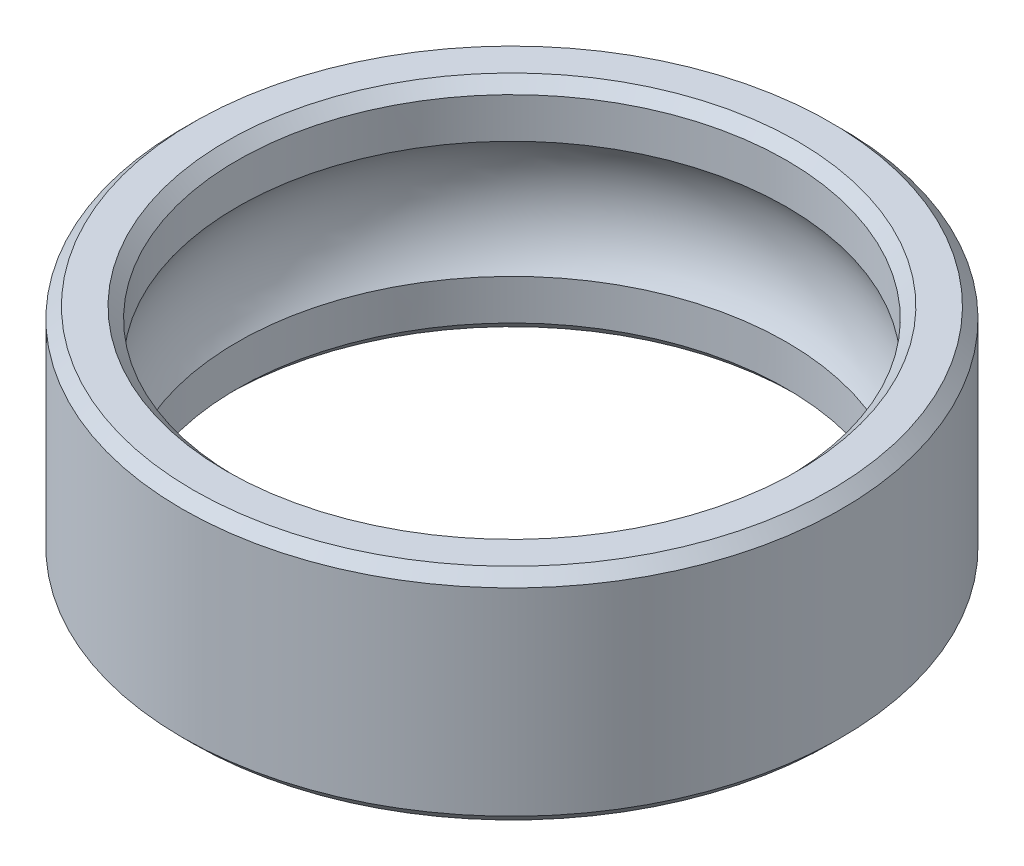
ISO-10303-21;
HEADER;
FILE_DESCRIPTION(('STEP AP214'),'2;1');
FILE_NAME('part.step','',(''),(''),'','','');
FILE_SCHEMA(('AUTOMOTIVE_DESIGN { 1 0 10303 214 1 1 1 1 }'));
ENDSEC;
DATA;
#1=APPLICATION_CONTEXT('core data for automotive mechanical design processes');
#2=APPLICATION_PROTOCOL_DEFINITION('international standard','automotive_design',2000,#1);
#3=PRODUCT_CONTEXT('',#1,'mechanical');
#4=PRODUCT('Part','Part','',(#3));
#5=PRODUCT_RELATED_PRODUCT_CATEGORY('part','',(#4));
#6=PRODUCT_DEFINITION_FORMATION('','',#4);
#7=PRODUCT_DEFINITION_CONTEXT('part definition',#1,'design');
#8=PRODUCT_DEFINITION('design','',#6,#7);
#9=PRODUCT_DEFINITION_SHAPE('','',#8);
#10=(LENGTH_UNIT() NAMED_UNIT(*) SI_UNIT(.MILLI.,.METRE.));
#11=(NAMED_UNIT(*) PLANE_ANGLE_UNIT() SI_UNIT($,.RADIAN.));
#12=(NAMED_UNIT(*) SI_UNIT($,.STERADIAN.) SOLID_ANGLE_UNIT());
#13=UNCERTAINTY_MEASURE_WITH_UNIT(LENGTH_MEASURE(1.E-05),#10,'distance_accuracy_value','');
#14=(GEOMETRIC_REPRESENTATION_CONTEXT(3) GLOBAL_UNCERTAINTY_ASSIGNED_CONTEXT((#13)) GLOBAL_UNIT_ASSIGNED_CONTEXT((#10,
#11,#12)) REPRESENTATION_CONTEXT('',''));
#15=CARTESIAN_POINT('',(0.,0.,0.));
#16=DIRECTION('',(0.,0.,1.));
#17=DIRECTION('',(1.,0.,0.));
#18=AXIS2_PLACEMENT_3D('',#15,#16,#17);
#19=CARTESIAN_POINT('',(0.,2.,0.));
#20=DIRECTION('',(0.,-1.,0.));
#21=DIRECTION('',(0.,0.,-1.));
#22=AXIS2_PLACEMENT_3D('',#19,#20,#21);
#23=CYLINDRICAL_SURFACE('',#22,5.);
#24=CARTESIAN_POINT('',(0.,-1.8,0.));
#25=DIRECTION('',(0.,1.,0.));
#26=DIRECTION('',(0.,0.,1.));
#27=AXIS2_PLACEMENT_3D('',#24,#25,#26);
#28=CIRCLE('',#27,5.);
#29=CARTESIAN_POINT('',(0.,-1.8,5.));
#30=VERTEX_POINT('',#29);
#31=EDGE_CURVE('E45',#30,#30,#28,.F.);
#32=ORIENTED_EDGE('',*,*,#31,.T.);
#33=EDGE_LOOP('',(#32));
#34=FACE_BOUND('',#33,.T.);
#35=CARTESIAN_POINT('',(0.,-1.06530248902254,0.));
#36=DIRECTION('',(0.,1.,0.));
#37=DIRECTION('',(0.,0.,1.));
#38=AXIS2_PLACEMENT_3D('',#35,#36,#37);
#39=CIRCLE('',#38,5.);
#40=CARTESIAN_POINT('',(0.,-1.06530248902254,5.));
#41=VERTEX_POINT('',#40);
#42=EDGE_CURVE('E36',#41,#41,#39,.T.);
#43=ORIENTED_EDGE('',*,*,#42,.T.);
#44=EDGE_LOOP('',(#43));
#45=FACE_BOUND('',#44,.T.);
#46=ADVANCED_FACE('F32',(#34,#45),#23,.F.);
#47=CARTESIAN_POINT('',(0.,1.8,0.));
#48=DIRECTION('',(0.,1.,0.));
#49=DIRECTION('',(0.,0.,1.));
#50=AXIS2_PLACEMENT_3D('',#47,#48,#49);
#51=CIRCLE('',#50,5.);
#52=CARTESIAN_POINT('',(0.,1.8,5.));
#53=VERTEX_POINT('',#52);
#54=EDGE_CURVE('E70',#53,#53,#51,.T.);
#55=ORIENTED_EDGE('',*,*,#54,.T.);
#56=EDGE_LOOP('',(#55));
#57=FACE_BOUND('',#56,.T.);
#58=CARTESIAN_POINT('',(0.,1.06530248902254,0.));
#59=DIRECTION('',(0.,-1.,0.));
#60=DIRECTION('',(0.,0.,-1.));
#61=AXIS2_PLACEMENT_3D('',#58,#59,#60);
#62=CIRCLE('',#61,5.);
#63=CARTESIAN_POINT('',(0.,1.06530248902254,-5.));
#64=VERTEX_POINT('',#63);
#65=EDGE_CURVE('E48',#64,#64,#62,.T.);
#66=ORIENTED_EDGE('',*,*,#65,.T.);
#67=EDGE_LOOP('',(#66));
#68=FACE_BOUND('',#67,.T.);
#69=ADVANCED_FACE('F96',(#57,#68),#23,.F.);
#70=CARTESIAN_POINT('',(0.,2.,0.));
#71=DIRECTION('',(0.,1.,0.));
#72=DIRECTION('',(0.,0.,1.));
#73=AXIS2_PLACEMENT_3D('',#70,#71,#72);
#74=PLANE('',#73);
#75=CARTESIAN_POINT('',(0.,2.,0.));
#76=DIRECTION('',(0.,1.,0.));
#77=DIRECTION('',(0.,0.,1.));
#78=AXIS2_PLACEMENT_3D('',#75,#76,#77);
#79=CIRCLE('',#78,5.8);
#80=CARTESIAN_POINT('',(0.,2.,5.8));
#81=VERTEX_POINT('',#80);
#82=EDGE_CURVE('E10',#81,#81,#79,.T.);
#83=ORIENTED_EDGE('',*,*,#82,.T.);
#84=EDGE_LOOP('',(#83));
#85=FACE_BOUND('',#84,.T.);
#86=CARTESIAN_POINT('',(0.,2.,0.));
#87=DIRECTION('',(0.,1.,0.));
#88=DIRECTION('',(0.,0.,1.));
#89=AXIS2_PLACEMENT_3D('',#86,#87,#88);
#90=CIRCLE('',#89,5.2);
#91=CARTESIAN_POINT('',(0.,2.,5.2));
#92=VERTEX_POINT('',#91);
#93=EDGE_CURVE('E40',#92,#92,#90,.F.);
#94=ORIENTED_EDGE('',*,*,#93,.T.);
#95=EDGE_LOOP('',(#94));
#96=FACE_BOUND('',#95,.T.);
#97=ADVANCED_FACE('F87',(#85,#96),#74,.T.);
#98=CARTESIAN_POINT('',(0.,-2.,0.));
#99=DIRECTION('',(0.,1.,0.));
#100=DIRECTION('',(0.,0.,1.));
#101=AXIS2_PLACEMENT_3D('',#98,#99,#100);
#102=PLANE('',#101);
#103=CARTESIAN_POINT('',(0.,-2.,0.));
#104=DIRECTION('',(0.,1.,0.));
#105=DIRECTION('',(0.,0.,1.));
#106=AXIS2_PLACEMENT_3D('',#103,#104,#105);
#107=CIRCLE('',#106,5.8);
#108=CARTESIAN_POINT('',(0.,-2.,5.8));
#109=VERTEX_POINT('',#108);
#110=EDGE_CURVE('E67',#109,#109,#107,.F.);
#111=ORIENTED_EDGE('',*,*,#110,.T.);
#112=EDGE_LOOP('',(#111));
#113=FACE_BOUND('',#112,.T.);
#114=CARTESIAN_POINT('',(0.,-2.,0.));
#115=DIRECTION('',(0.,1.,0.));
#116=DIRECTION('',(0.,0.,1.));
#117=AXIS2_PLACEMENT_3D('',#114,#115,#116);
#118=CIRCLE('',#117,5.2);
#119=CARTESIAN_POINT('',(0.,-2.,5.2));
#120=VERTEX_POINT('',#119);
#121=EDGE_CURVE('E62',#120,#120,#118,.T.);
#122=ORIENTED_EDGE('',*,*,#121,.T.);
#123=EDGE_LOOP('',(#122));
#124=FACE_BOUND('',#123,.T.);
#125=ADVANCED_FACE('F84',(#113,#124),#102,.F.);
#126=CARTESIAN_POINT('',(0.,2.,0.));
#127=DIRECTION('',(0.,-1.,0.));
#128=DIRECTION('',(0.,0.,-1.));
#129=AXIS2_PLACEMENT_3D('',#126,#127,#128);
#130=CYLINDRICAL_SURFACE('',#129,6.);
#131=CARTESIAN_POINT('',(0.,-1.8,0.));
#132=DIRECTION('',(0.,1.,0.));
#133=DIRECTION('',(0.,0.,1.));
#134=AXIS2_PLACEMENT_3D('',#131,#132,#133);
#135=CIRCLE('',#134,6.);
#136=CARTESIAN_POINT('',(0.,-1.8,6.));
#137=VERTEX_POINT('',#136);
#138=EDGE_CURVE('E57',#137,#137,#135,.T.);
#139=ORIENTED_EDGE('',*,*,#138,.T.);
#140=EDGE_LOOP('',(#139));
#141=FACE_BOUND('',#140,.T.);
#142=CARTESIAN_POINT('',(0.,1.8,0.));
#143=DIRECTION('',(0.,1.,0.));
#144=DIRECTION('',(0.,0.,1.));
#145=AXIS2_PLACEMENT_3D('',#142,#143,#144);
#146=CIRCLE('',#145,6.);
#147=CARTESIAN_POINT('',(0.,1.8,6.));
#148=VERTEX_POINT('',#147);
#149=EDGE_CURVE('E53',#148,#148,#146,.F.);
#150=ORIENTED_EDGE('',*,*,#149,.T.);
#151=EDGE_LOOP('',(#150));
#152=FACE_BOUND('',#151,.T.);
#153=ADVANCED_FACE('F86',(#141,#152),#130,.T.);
#154=CARTESIAN_POINT('',(0.,-1.8,0.));
#155=DIRECTION('',(0.,1.,0.));
#156=DIRECTION('',(0.,0.,1.));
#157=AXIS2_PLACEMENT_3D('',#154,#155,#156);
#158=CONICAL_SURFACE('',#157,6.,0.78539816339745);
#159=ORIENTED_EDGE('',*,*,#110,.F.);
#160=EDGE_LOOP('',(#159));
#161=FACE_BOUND('',#160,.T.);
#162=ORIENTED_EDGE('',*,*,#138,.F.);
#163=EDGE_LOOP('',(#162));
#164=FACE_BOUND('',#163,.T.);
#165=ADVANCED_FACE('F80',(#161,#164),#158,.T.);
#166=CARTESIAN_POINT('',(0.,-2.,0.));
#167=DIRECTION('',(0.,-1.,0.));
#168=DIRECTION('',(0.,0.,-1.));
#169=AXIS2_PLACEMENT_3D('',#166,#167,#168);
#170=CONICAL_SURFACE('',#169,5.2,0.785398163397448);
#171=ORIENTED_EDGE('',*,*,#31,.F.);
#172=EDGE_LOOP('',(#171));
#173=FACE_BOUND('',#172,.T.);
#174=ORIENTED_EDGE('',*,*,#121,.F.);
#175=EDGE_LOOP('',(#174));
#176=FACE_BOUND('',#175,.T.);
#177=ADVANCED_FACE('F76',(#173,#176),#170,.F.);
#178=CARTESIAN_POINT('',(0.,2.,0.));
#179=DIRECTION('',(0.,-1.,0.));
#180=DIRECTION('',(0.,0.,-1.));
#181=AXIS2_PLACEMENT_3D('',#178,#179,#180);
#182=CONICAL_SURFACE('',#181,5.8,0.785398163397455);
#183=ORIENTED_EDGE('',*,*,#149,.F.);
#184=EDGE_LOOP('',(#183));
#185=FACE_BOUND('',#184,.T.);
#186=ORIENTED_EDGE('',*,*,#82,.F.);
#187=EDGE_LOOP('',(#186));
#188=FACE_BOUND('',#187,.T.);
#189=ADVANCED_FACE('F79',(#185,#188),#182,.T.);
#190=CARTESIAN_POINT('',(0.,1.8,0.));
#191=DIRECTION('',(0.,1.,0.));
#192=DIRECTION('',(0.,0.,1.));
#193=AXIS2_PLACEMENT_3D('',#190,#191,#192);
#194=CONICAL_SURFACE('',#193,5.,0.78539816339745);
#195=ORIENTED_EDGE('',*,*,#93,.F.);
#196=EDGE_LOOP('',(#195));
#197=FACE_BOUND('',#196,.T.);
#198=ORIENTED_EDGE('',*,*,#54,.F.);
#199=EDGE_LOOP('',(#198));
#200=FACE_BOUND('',#199,.T.);
#201=ADVANCED_FACE('F34',(#197,#200),#194,.F.);
#202=CARTESIAN_POINT('',(0.,0.,0.));
#203=DIRECTION('',(0.,-1.,0.));
#204=DIRECTION('',(0.,0.,-1.));
#205=AXIS2_PLACEMENT_3D('',#202,#203,#204);
#206=TOROIDAL_SURFACE('',#205,3.54909317773938,1.8);
#207=ORIENTED_EDGE('',*,*,#42,.F.);
#208=EDGE_LOOP('',(#207));
#209=FACE_BOUND('',#208,.T.);
#210=ORIENTED_EDGE('',*,*,#65,.F.);
#211=EDGE_LOOP('',(#210));
#212=FACE_BOUND('',#211,.T.);
#213=ADVANCED_FACE('F105',(#209,#212),#206,.F.);
#214=CLOSED_SHELL('',(#46,#69,#97,#125,#153,#165,#177,#189,#201,#213));
#215=MANIFOLD_SOLID_BREP('B2',#214);
#216=ADVANCED_BREP_SHAPE_REPRESENTATION('',(#18,#215),#14);
#217=SHAPE_DEFINITION_REPRESENTATION(#9,#216);
ENDSEC;
END-ISO-10303-21;
